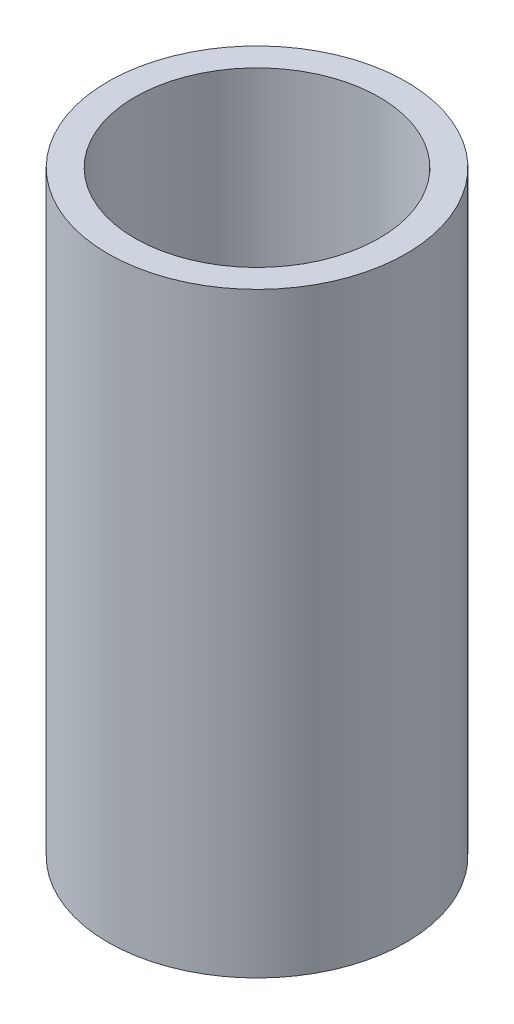
ISO-10303-21;
HEADER;
FILE_DESCRIPTION(('STEP AP214'),'2;1');
FILE_NAME('part.step','',(''),(''),'','','');
FILE_SCHEMA(('AUTOMOTIVE_DESIGN { 1 0 10303 214 1 1 1 1 }'));
ENDSEC;
DATA;
#1=APPLICATION_CONTEXT('core data for automotive mechanical design processes');
#2=APPLICATION_PROTOCOL_DEFINITION('international standard','automotive_design',2000,#1);
#3=PRODUCT_CONTEXT('',#1,'mechanical');
#4=PRODUCT('Part','Part','',(#3));
#5=PRODUCT_RELATED_PRODUCT_CATEGORY('part','',(#4));
#6=PRODUCT_DEFINITION_FORMATION('','',#4);
#7=PRODUCT_DEFINITION_CONTEXT('part definition',#1,'design');
#8=PRODUCT_DEFINITION('design','',#6,#7);
#9=PRODUCT_DEFINITION_SHAPE('','',#8);
#10=(LENGTH_UNIT() NAMED_UNIT(*) SI_UNIT(.MILLI.,.METRE.));
#11=(NAMED_UNIT(*) PLANE_ANGLE_UNIT() SI_UNIT($,.RADIAN.));
#12=(NAMED_UNIT(*) SI_UNIT($,.STERADIAN.) SOLID_ANGLE_UNIT());
#13=UNCERTAINTY_MEASURE_WITH_UNIT(LENGTH_MEASURE(1.E-05),#10,'distance_accuracy_value','');
#14=(GEOMETRIC_REPRESENTATION_CONTEXT(3) GLOBAL_UNCERTAINTY_ASSIGNED_CONTEXT((#13)) GLOBAL_UNIT_ASSIGNED_CONTEXT((#10,
#11,#12)) REPRESENTATION_CONTEXT('',''));
#15=CARTESIAN_POINT('',(0.,0.,0.));
#16=DIRECTION('',(0.,0.,1.));
#17=DIRECTION('',(1.,0.,0.));
#18=AXIS2_PLACEMENT_3D('',#15,#16,#17);
#19=CARTESIAN_POINT('',(0.,50.8,0.));
#20=DIRECTION('',(0.,1.,0.));
#21=DIRECTION('',(0.,0.,1.));
#22=AXIS2_PLACEMENT_3D('',#19,#20,#21);
#23=PLANE('',#22);
#24=CARTESIAN_POINT('',(0.,50.8,0.));
#25=DIRECTION('',(0.,1.,0.));
#26=DIRECTION('',(0.,0.,1.));
#27=AXIS2_PLACEMENT_3D('',#24,#25,#26);
#28=CIRCLE('',#27,12.7);
#29=CARTESIAN_POINT('',(0.,50.8,12.7));
#30=VERTEX_POINT('',#29);
#31=EDGE_CURVE('E10',#30,#30,#28,.T.);
#32=ORIENTED_EDGE('',*,*,#31,.T.);
#33=EDGE_LOOP('',(#32));
#34=FACE_BOUND('',#33,.T.);
#35=CARTESIAN_POINT('',(0.,50.8,0.));
#36=DIRECTION('',(0.,1.,0.));
#37=DIRECTION('',(0.,0.,1.));
#38=AXIS2_PLACEMENT_3D('',#35,#36,#37);
#39=CIRCLE('',#38,10.414);
#40=CARTESIAN_POINT('',(0.,50.8,10.414));
#41=VERTEX_POINT('',#40);
#42=EDGE_CURVE('E44',#41,#41,#39,.T.);
#43=ORIENTED_EDGE('',*,*,#42,.F.);
#44=EDGE_LOOP('',(#43));
#45=FACE_BOUND('',#44,.T.);
#46=ADVANCED_FACE('F33',(#34,#45),#23,.T.);
#47=CARTESIAN_POINT('',(0.,0.,0.));
#48=DIRECTION('',(0.,1.,0.));
#49=DIRECTION('',(0.,0.,1.));
#50=AXIS2_PLACEMENT_3D('',#47,#48,#49);
#51=PLANE('',#50);
#52=CARTESIAN_POINT('',(0.,0.,0.));
#53=DIRECTION('',(0.,1.,0.));
#54=DIRECTION('',(0.,0.,1.));
#55=AXIS2_PLACEMENT_3D('',#52,#53,#54);
#56=CIRCLE('',#55,12.7);
#57=CARTESIAN_POINT('',(0.,0.,12.7));
#58=VERTEX_POINT('',#57);
#59=EDGE_CURVE('E37',#58,#58,#56,.T.);
#60=ORIENTED_EDGE('',*,*,#59,.F.);
#61=EDGE_LOOP('',(#60));
#62=FACE_BOUND('',#61,.T.);
#63=CARTESIAN_POINT('',(0.,0.,0.));
#64=DIRECTION('',(0.,1.,0.));
#65=DIRECTION('',(0.,0.,1.));
#66=AXIS2_PLACEMENT_3D('',#63,#64,#65);
#67=CIRCLE('',#66,10.414);
#68=CARTESIAN_POINT('',(0.,0.,10.414));
#69=VERTEX_POINT('',#68);
#70=EDGE_CURVE('E46',#69,#69,#67,.T.);
#71=ORIENTED_EDGE('',*,*,#70,.T.);
#72=EDGE_LOOP('',(#71));
#73=FACE_BOUND('',#72,.T.);
#74=ADVANCED_FACE('F56',(#62,#73),#51,.F.);
#75=CARTESIAN_POINT('',(0.,50.8,0.));
#76=DIRECTION('',(0.,-1.,0.));
#77=DIRECTION('',(0.,0.,-1.));
#78=AXIS2_PLACEMENT_3D('',#75,#76,#77);
#79=CYLINDRICAL_SURFACE('',#78,12.7);
#80=ORIENTED_EDGE('',*,*,#31,.F.);
#81=EDGE_LOOP('',(#80));
#82=FACE_BOUND('',#81,.T.);
#83=ORIENTED_EDGE('',*,*,#59,.T.);
#84=EDGE_LOOP('',(#83));
#85=FACE_BOUND('',#84,.T.);
#86=ADVANCED_FACE('F35',(#82,#85),#79,.T.);
#87=CARTESIAN_POINT('',(0.,50.8,0.));
#88=DIRECTION('',(0.,-1.,0.));
#89=DIRECTION('',(0.,0.,-1.));
#90=AXIS2_PLACEMENT_3D('',#87,#88,#89);
#91=CYLINDRICAL_SURFACE('',#90,10.414);
#92=ORIENTED_EDGE('',*,*,#42,.T.);
#93=EDGE_LOOP('',(#92));
#94=FACE_BOUND('',#93,.T.);
#95=ORIENTED_EDGE('',*,*,#70,.F.);
#96=EDGE_LOOP('',(#95));
#97=FACE_BOUND('',#96,.T.);
#98=ADVANCED_FACE('F52',(#94,#97),#91,.F.);
#99=CLOSED_SHELL('',(#46,#74,#86,#98));
#100=MANIFOLD_SOLID_BREP('B2',#99);
#101=ADVANCED_BREP_SHAPE_REPRESENTATION('',(#18,#100),#14);
#102=SHAPE_DEFINITION_REPRESENTATION(#9,#101);
ENDSEC;
END-ISO-10303-21;
